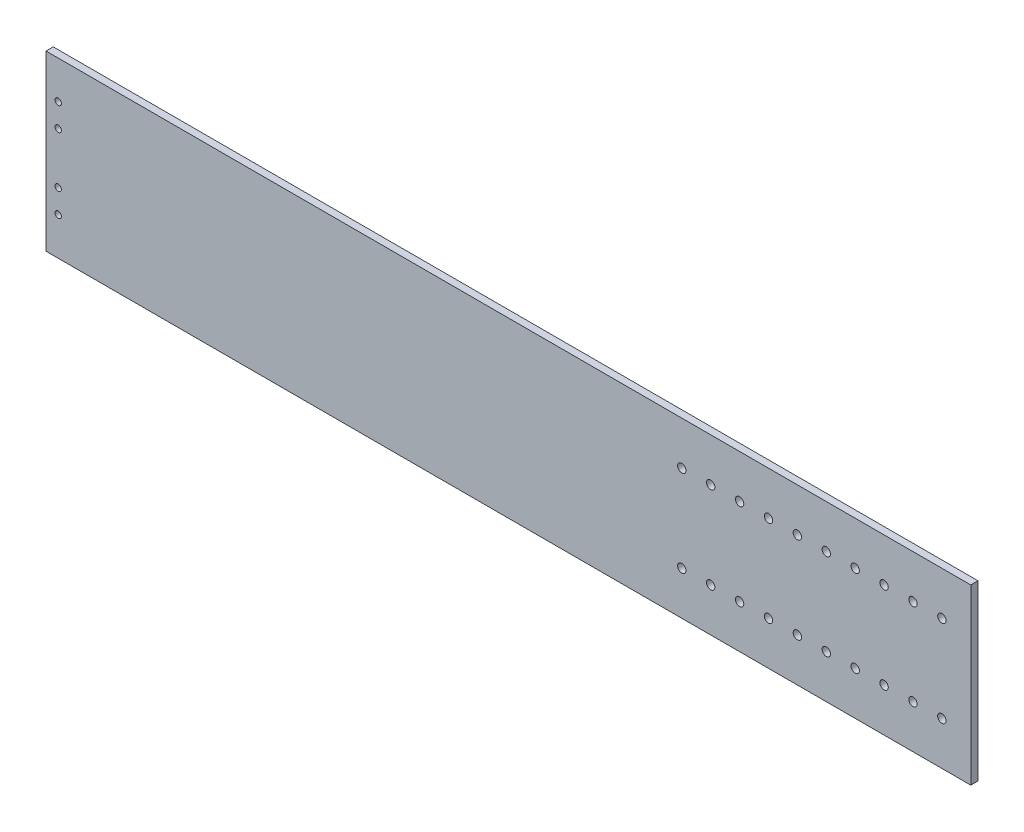
ISO-10303-21;
HEADER;
FILE_DESCRIPTION(('STEP AP214'),'2;1');
FILE_NAME('part.step','',(''),(''),'','','');
FILE_SCHEMA(('AUTOMOTIVE_DESIGN { 1 0 10303 214 1 1 1 1 }'));
ENDSEC;
DATA;
#1=APPLICATION_CONTEXT('core data for automotive mechanical design processes');
#2=APPLICATION_PROTOCOL_DEFINITION('international standard','automotive_design',2000,#1);
#3=PRODUCT_CONTEXT('',#1,'mechanical');
#4=PRODUCT('Part','Part','',(#3));
#5=PRODUCT_RELATED_PRODUCT_CATEGORY('part','',(#4));
#6=PRODUCT_DEFINITION_FORMATION('','',#4);
#7=PRODUCT_DEFINITION_CONTEXT('part definition',#1,'design');
#8=PRODUCT_DEFINITION('design','',#6,#7);
#9=PRODUCT_DEFINITION_SHAPE('','',#8);
#10=(LENGTH_UNIT() NAMED_UNIT(*) SI_UNIT(.MILLI.,.METRE.));
#11=(NAMED_UNIT(*) PLANE_ANGLE_UNIT() SI_UNIT($,.RADIAN.));
#12=(NAMED_UNIT(*) SI_UNIT($,.STERADIAN.) SOLID_ANGLE_UNIT());
#13=UNCERTAINTY_MEASURE_WITH_UNIT(LENGTH_MEASURE(1.E-05),#10,'distance_accuracy_value','');
#14=(GEOMETRIC_REPRESENTATION_CONTEXT(3) GLOBAL_UNCERTAINTY_ASSIGNED_CONTEXT((#13)) GLOBAL_UNIT_ASSIGNED_CONTEXT((#10,
#11,#12)) REPRESENTATION_CONTEXT('',''));
#15=CARTESIAN_POINT('',(0.,0.,0.));
#16=DIRECTION('',(0.,0.,1.));
#17=DIRECTION('',(1.,0.,0.));
#18=AXIS2_PLACEMENT_3D('',#15,#16,#17);
#19=CARTESIAN_POINT('',(0.,0.,3.175));
#20=DIRECTION('',(1.,0.,0.));
#21=DIRECTION('',(0.,0.,-1.));
#22=AXIS2_PLACEMENT_3D('',#19,#20,#21);
#23=PLANE('',#22);
#24=DIRECTION('',(0.,-1.,0.));
#25=VECTOR('',#24,1.);
#26=CARTESIAN_POINT('',(0.,0.,0.));
#27=LINE('',#26,#25);
#28=CARTESIAN_POINT('',(0.,76.2,0.));
#29=VERTEX_POINT('',#28);
#30=CARTESIAN_POINT('',(0.,0.,0.));
#31=VERTEX_POINT('',#30);
#32=EDGE_CURVE('E96',#29,#31,#27,.T.);
#33=ORIENTED_EDGE('',*,*,#32,.T.);
#34=DIRECTION('',(0.,0.,-1.));
#35=VECTOR('',#34,1.);
#36=CARTESIAN_POINT('',(0.,0.,3.175));
#37=LINE('',#36,#35);
#38=CARTESIAN_POINT('',(0.,0.,3.175));
#39=VERTEX_POINT('',#38);
#40=EDGE_CURVE('E11',#39,#31,#37,.T.);
#41=ORIENTED_EDGE('',*,*,#40,.F.);
#42=DIRECTION('',(0.,-1.,0.));
#43=VECTOR('',#42,1.);
#44=CARTESIAN_POINT('',(0.,0.,3.175));
#45=LINE('',#44,#43);
#46=CARTESIAN_POINT('',(0.,76.2,3.175));
#47=VERTEX_POINT('',#46);
#48=EDGE_CURVE('E84',#47,#39,#45,.T.);
#49=ORIENTED_EDGE('',*,*,#48,.F.);
#50=DIRECTION('',(0.,0.,-1.));
#51=VECTOR('',#50,1.);
#52=CARTESIAN_POINT('',(0.,76.2,3.175));
#53=LINE('',#52,#51);
#54=EDGE_CURVE('E92',#47,#29,#53,.T.);
#55=ORIENTED_EDGE('',*,*,#54,.T.);
#56=EDGE_LOOP('',(#33,#41,#49,#55));
#57=FACE_BOUND('',#56,.T.);
#58=ADVANCED_FACE('F33',(#57),#23,.F.);
#59=CARTESIAN_POINT('',(0.,0.,3.175));
#60=DIRECTION('',(0.,1.,0.));
#61=DIRECTION('',(0.,0.,1.));
#62=AXIS2_PLACEMENT_3D('',#59,#60,#61);
#63=PLANE('',#62);
#64=DIRECTION('',(1.,0.,0.));
#65=VECTOR('',#64,1.);
#66=CARTESIAN_POINT('',(0.,0.,0.));
#67=LINE('',#66,#65);
#68=CARTESIAN_POINT('',(406.4,0.,0.));
#69=VERTEX_POINT('',#68);
#70=EDGE_CURVE('E88',#31,#69,#67,.T.);
#71=ORIENTED_EDGE('',*,*,#70,.T.);
#72=DIRECTION('',(0.,0.,-1.));
#73=VECTOR('',#72,1.);
#74=CARTESIAN_POINT('',(406.4,0.,3.175));
#75=LINE('',#74,#73);
#76=CARTESIAN_POINT('',(406.4,0.,3.175));
#77=VERTEX_POINT('',#76);
#78=EDGE_CURVE('E41',#77,#69,#75,.T.);
#79=ORIENTED_EDGE('',*,*,#78,.F.);
#80=DIRECTION('',(1.,0.,0.));
#81=VECTOR('',#80,1.);
#82=CARTESIAN_POINT('',(0.,0.,3.175));
#83=LINE('',#82,#81);
#84=EDGE_CURVE('E79',#39,#77,#83,.T.);
#85=ORIENTED_EDGE('',*,*,#84,.F.);
#86=ORIENTED_EDGE('',*,*,#40,.T.);
#87=EDGE_LOOP('',(#71,#79,#85,#86));
#88=FACE_BOUND('',#87,.T.);
#89=ADVANCED_FACE('F87',(#88),#63,.F.);
#90=CARTESIAN_POINT('',(406.4,0.,3.175));
#91=DIRECTION('',(-1.,0.,0.));
#92=DIRECTION('',(0.,0.,1.));
#93=AXIS2_PLACEMENT_3D('',#90,#91,#92);
#94=PLANE('',#93);
#95=DIRECTION('',(0.,1.,0.));
#96=VECTOR('',#95,1.);
#97=CARTESIAN_POINT('',(406.4,0.,0.));
#98=LINE('',#97,#96);
#99=CARTESIAN_POINT('',(406.4,76.2,0.));
#100=VERTEX_POINT('',#99);
#101=EDGE_CURVE('E66',#69,#100,#98,.T.);
#102=ORIENTED_EDGE('',*,*,#101,.T.);
#103=DIRECTION('',(0.,0.,-1.));
#104=VECTOR('',#103,1.);
#105=CARTESIAN_POINT('',(406.4,76.2,3.175));
#106=LINE('',#105,#104);
#107=CARTESIAN_POINT('',(406.4,76.2,3.175));
#108=VERTEX_POINT('',#107);
#109=EDGE_CURVE('E89',#108,#100,#106,.T.);
#110=ORIENTED_EDGE('',*,*,#109,.F.);
#111=DIRECTION('',(0.,1.,0.));
#112=VECTOR('',#111,1.);
#113=CARTESIAN_POINT('',(406.4,0.,3.175));
#114=LINE('',#113,#112);
#115=EDGE_CURVE('E82',#77,#108,#114,.T.);
#116=ORIENTED_EDGE('',*,*,#115,.F.);
#117=ORIENTED_EDGE('',*,*,#78,.T.);
#118=EDGE_LOOP('',(#102,#110,#116,#117));
#119=FACE_BOUND('',#118,.T.);
#120=ADVANCED_FACE('F90',(#119),#94,.F.);
#121=CARTESIAN_POINT('',(0.,76.2,3.175));
#122=DIRECTION('',(0.,-1.,0.));
#123=DIRECTION('',(0.,0.,-1.));
#124=AXIS2_PLACEMENT_3D('',#121,#122,#123);
#125=PLANE('',#124);
#126=DIRECTION('',(-1.,0.,0.));
#127=VECTOR('',#126,1.);
#128=CARTESIAN_POINT('',(0.,76.2,0.));
#129=LINE('',#128,#127);
#130=EDGE_CURVE('E72',#100,#29,#129,.T.);
#131=ORIENTED_EDGE('',*,*,#130,.T.);
#132=ORIENTED_EDGE('',*,*,#54,.F.);
#133=DIRECTION('',(-1.,0.,0.));
#134=VECTOR('',#133,1.);
#135=CARTESIAN_POINT('',(0.,76.2,3.175));
#136=LINE('',#135,#134);
#137=EDGE_CURVE('E49',#108,#47,#136,.T.);
#138=ORIENTED_EDGE('',*,*,#137,.F.);
#139=ORIENTED_EDGE('',*,*,#109,.T.);
#140=EDGE_LOOP('',(#131,#132,#138,#139));
#141=FACE_BOUND('',#140,.T.);
#142=ADVANCED_FACE('F104',(#141),#125,.F.);
#143=CARTESIAN_POINT('',(0.,76.2,3.175));
#144=DIRECTION('',(0.,0.,-1.));
#145=DIRECTION('',(-1.,0.,0.));
#146=AXIS2_PLACEMENT_3D('',#143,#144,#145);
#147=PLANE('',#146);
#148=CARTESIAN_POINT('',(279.4,19.05,3.175));
#149=DIRECTION('',(0.,0.,1.));
#150=DIRECTION('',(-1.,0.,0.));
#151=AXIS2_PLACEMENT_3D('',#148,#149,#150);
#152=CIRCLE('',#151,1.84150000000001);
#153=CARTESIAN_POINT('',(277.5585,19.05,3.175));
#154=VERTEX_POINT('',#153);
#155=EDGE_CURVE('E248',#154,#154,#152,.T.);
#156=ORIENTED_EDGE('',*,*,#155,.F.);
#157=EDGE_LOOP('',(#156));
#158=FACE_BOUND('',#157,.T.);
#159=CARTESIAN_POINT('',(292.1,19.05,3.175));
#160=DIRECTION('',(0.,0.,1.));
#161=DIRECTION('',(-1.,0.,0.));
#162=AXIS2_PLACEMENT_3D('',#159,#160,#161);
#163=CIRCLE('',#162,1.84150000000001);
#164=CARTESIAN_POINT('',(290.2585,19.05,3.175));
#165=VERTEX_POINT('',#164);
#166=EDGE_CURVE('E242',#165,#165,#163,.T.);
#167=ORIENTED_EDGE('',*,*,#166,.F.);
#168=EDGE_LOOP('',(#167));
#169=FACE_BOUND('',#168,.T.);
#170=CARTESIAN_POINT('',(304.8,19.05,3.175));
#171=DIRECTION('',(0.,0.,1.));
#172=DIRECTION('',(-1.,0.,0.));
#173=AXIS2_PLACEMENT_3D('',#170,#171,#172);
#174=CIRCLE('',#173,1.84150000000001);
#175=CARTESIAN_POINT('',(302.9585,19.05,3.175));
#176=VERTEX_POINT('',#175);
#177=EDGE_CURVE('E236',#176,#176,#174,.T.);
#178=ORIENTED_EDGE('',*,*,#177,.F.);
#179=EDGE_LOOP('',(#178));
#180=FACE_BOUND('',#179,.T.);
#181=CARTESIAN_POINT('',(317.5,19.05,3.175));
#182=DIRECTION('',(0.,0.,1.));
#183=DIRECTION('',(-1.,0.,0.));
#184=AXIS2_PLACEMENT_3D('',#181,#182,#183);
#185=CIRCLE('',#184,1.84149999999996);
#186=CARTESIAN_POINT('',(315.6585,19.05,3.175));
#187=VERTEX_POINT('',#186);
#188=EDGE_CURVE('E230',#187,#187,#185,.T.);
#189=ORIENTED_EDGE('',*,*,#188,.F.);
#190=EDGE_LOOP('',(#189));
#191=FACE_BOUND('',#190,.T.);
#192=CARTESIAN_POINT('',(330.2,19.05,3.175));
#193=DIRECTION('',(0.,0.,1.));
#194=DIRECTION('',(-1.,0.,0.));
#195=AXIS2_PLACEMENT_3D('',#192,#193,#194);
#196=CIRCLE('',#195,1.84150000000001);
#197=CARTESIAN_POINT('',(328.3585,19.05,3.175));
#198=VERTEX_POINT('',#197);
#199=EDGE_CURVE('E224',#198,#198,#196,.T.);
#200=ORIENTED_EDGE('',*,*,#199,.F.);
#201=EDGE_LOOP('',(#200));
#202=FACE_BOUND('',#201,.T.);
#203=CARTESIAN_POINT('',(342.9,19.05,3.175));
#204=DIRECTION('',(0.,0.,1.));
#205=DIRECTION('',(-1.,0.,0.));
#206=AXIS2_PLACEMENT_3D('',#203,#204,#205);
#207=CIRCLE('',#206,1.84150000000001);
#208=CARTESIAN_POINT('',(341.0585,19.05,3.175));
#209=VERTEX_POINT('',#208);
#210=EDGE_CURVE('E218',#209,#209,#207,.T.);
#211=ORIENTED_EDGE('',*,*,#210,.F.);
#212=EDGE_LOOP('',(#211));
#213=FACE_BOUND('',#212,.T.);
#214=CARTESIAN_POINT('',(355.6,19.05,3.175));
#215=DIRECTION('',(0.,0.,1.));
#216=DIRECTION('',(-1.,0.,0.));
#217=AXIS2_PLACEMENT_3D('',#214,#215,#216);
#218=CIRCLE('',#217,1.84150000000001);
#219=CARTESIAN_POINT('',(353.7585,19.05,3.175));
#220=VERTEX_POINT('',#219);
#221=EDGE_CURVE('E212',#220,#220,#218,.T.);
#222=ORIENTED_EDGE('',*,*,#221,.F.);
#223=EDGE_LOOP('',(#222));
#224=FACE_BOUND('',#223,.T.);
#225=CARTESIAN_POINT('',(368.3,19.05,3.175));
#226=DIRECTION('',(0.,0.,1.));
#227=DIRECTION('',(-1.,0.,0.));
#228=AXIS2_PLACEMENT_3D('',#225,#226,#227);
#229=CIRCLE('',#228,1.84150000000001);
#230=CARTESIAN_POINT('',(366.4585,19.05,3.175));
#231=VERTEX_POINT('',#230);
#232=EDGE_CURVE('E206',#231,#231,#229,.T.);
#233=ORIENTED_EDGE('',*,*,#232,.F.);
#234=EDGE_LOOP('',(#233));
#235=FACE_BOUND('',#234,.T.);
#236=CARTESIAN_POINT('',(381.,19.05,3.175));
#237=DIRECTION('',(0.,0.,1.));
#238=DIRECTION('',(-1.,0.,0.));
#239=AXIS2_PLACEMENT_3D('',#236,#237,#238);
#240=CIRCLE('',#239,1.84149999999996);
#241=CARTESIAN_POINT('',(379.1585,19.05,3.175));
#242=VERTEX_POINT('',#241);
#243=EDGE_CURVE('E200',#242,#242,#240,.T.);
#244=ORIENTED_EDGE('',*,*,#243,.F.);
#245=EDGE_LOOP('',(#244));
#246=FACE_BOUND('',#245,.T.);
#247=CARTESIAN_POINT('',(393.7,19.05,3.175));
#248=DIRECTION('',(0.,0.,1.));
#249=DIRECTION('',(-1.,0.,0.));
#250=AXIS2_PLACEMENT_3D('',#247,#248,#249);
#251=CIRCLE('',#250,1.84150000000001);
#252=CARTESIAN_POINT('',(391.8585,19.05,3.175));
#253=VERTEX_POINT('',#252);
#254=EDGE_CURVE('E194',#253,#253,#251,.T.);
#255=ORIENTED_EDGE('',*,*,#254,.F.);
#256=EDGE_LOOP('',(#255));
#257=FACE_BOUND('',#256,.T.);
#258=CARTESIAN_POINT('',(393.7,57.15,3.175));
#259=DIRECTION('',(0.,0.,1.));
#260=DIRECTION('',(1.,0.,0.));
#261=AXIS2_PLACEMENT_3D('',#258,#259,#260);
#262=CIRCLE('',#261,1.84150000000001);
#263=CARTESIAN_POINT('',(395.5415,57.15,3.175));
#264=VERTEX_POINT('',#263);
#265=EDGE_CURVE('E188',#264,#264,#262,.T.);
#266=ORIENTED_EDGE('',*,*,#265,.F.);
#267=EDGE_LOOP('',(#266));
#268=FACE_BOUND('',#267,.T.);
#269=CARTESIAN_POINT('',(381.,57.15,3.175));
#270=DIRECTION('',(0.,0.,1.));
#271=DIRECTION('',(1.,0.,0.));
#272=AXIS2_PLACEMENT_3D('',#269,#270,#271);
#273=CIRCLE('',#272,1.84149999999996);
#274=CARTESIAN_POINT('',(382.8415,57.15,3.175));
#275=VERTEX_POINT('',#274);
#276=EDGE_CURVE('E182',#275,#275,#273,.T.);
#277=ORIENTED_EDGE('',*,*,#276,.F.);
#278=EDGE_LOOP('',(#277));
#279=FACE_BOUND('',#278,.T.);
#280=CARTESIAN_POINT('',(368.3,57.15,3.175));
#281=DIRECTION('',(0.,0.,1.));
#282=DIRECTION('',(1.,0.,0.));
#283=AXIS2_PLACEMENT_3D('',#280,#281,#282);
#284=CIRCLE('',#283,1.84150000000001);
#285=CARTESIAN_POINT('',(370.1415,57.15,3.175));
#286=VERTEX_POINT('',#285);
#287=EDGE_CURVE('E176',#286,#286,#284,.T.);
#288=ORIENTED_EDGE('',*,*,#287,.F.);
#289=EDGE_LOOP('',(#288));
#290=FACE_BOUND('',#289,.T.);
#291=CARTESIAN_POINT('',(355.6,57.15,3.175));
#292=DIRECTION('',(0.,0.,1.));
#293=DIRECTION('',(1.,0.,0.));
#294=AXIS2_PLACEMENT_3D('',#291,#292,#293);
#295=CIRCLE('',#294,1.84150000000001);
#296=CARTESIAN_POINT('',(357.4415,57.15,3.175));
#297=VERTEX_POINT('',#296);
#298=EDGE_CURVE('E170',#297,#297,#295,.T.);
#299=ORIENTED_EDGE('',*,*,#298,.F.);
#300=EDGE_LOOP('',(#299));
#301=FACE_BOUND('',#300,.T.);
#302=CARTESIAN_POINT('',(342.9,57.15,3.175));
#303=DIRECTION('',(0.,0.,1.));
#304=DIRECTION('',(1.,0.,0.));
#305=AXIS2_PLACEMENT_3D('',#302,#303,#304);
#306=CIRCLE('',#305,1.84150000000001);
#307=CARTESIAN_POINT('',(344.7415,57.15,3.175));
#308=VERTEX_POINT('',#307);
#309=EDGE_CURVE('E164',#308,#308,#306,.T.);
#310=ORIENTED_EDGE('',*,*,#309,.F.);
#311=EDGE_LOOP('',(#310));
#312=FACE_BOUND('',#311,.T.);
#313=CARTESIAN_POINT('',(330.2,57.15,3.175));
#314=DIRECTION('',(0.,0.,1.));
#315=DIRECTION('',(1.,0.,0.));
#316=AXIS2_PLACEMENT_3D('',#313,#314,#315);
#317=CIRCLE('',#316,1.84150000000001);
#318=CARTESIAN_POINT('',(332.0415,57.15,3.175));
#319=VERTEX_POINT('',#318);
#320=EDGE_CURVE('E158',#319,#319,#317,.T.);
#321=ORIENTED_EDGE('',*,*,#320,.F.);
#322=EDGE_LOOP('',(#321));
#323=FACE_BOUND('',#322,.T.);
#324=CARTESIAN_POINT('',(317.5,57.15,3.175));
#325=DIRECTION('',(0.,0.,1.));
#326=DIRECTION('',(1.,0.,0.));
#327=AXIS2_PLACEMENT_3D('',#324,#325,#326);
#328=CIRCLE('',#327,1.84149999999996);
#329=CARTESIAN_POINT('',(319.3415,57.15,3.175));
#330=VERTEX_POINT('',#329);
#331=EDGE_CURVE('E152',#330,#330,#328,.T.);
#332=ORIENTED_EDGE('',*,*,#331,.F.);
#333=EDGE_LOOP('',(#332));
#334=FACE_BOUND('',#333,.T.);
#335=CARTESIAN_POINT('',(304.8,57.15,3.175));
#336=DIRECTION('',(0.,0.,1.));
#337=DIRECTION('',(1.,0.,0.));
#338=AXIS2_PLACEMENT_3D('',#335,#336,#337);
#339=CIRCLE('',#338,1.84150000000001);
#340=CARTESIAN_POINT('',(306.6415,57.15,3.175));
#341=VERTEX_POINT('',#340);
#342=EDGE_CURVE('E146',#341,#341,#339,.T.);
#343=ORIENTED_EDGE('',*,*,#342,.F.);
#344=EDGE_LOOP('',(#343));
#345=FACE_BOUND('',#344,.T.);
#346=CARTESIAN_POINT('',(292.1,57.15,3.175));
#347=DIRECTION('',(0.,0.,1.));
#348=DIRECTION('',(1.,0.,0.));
#349=AXIS2_PLACEMENT_3D('',#346,#347,#348);
#350=CIRCLE('',#349,1.84150000000001);
#351=CARTESIAN_POINT('',(293.9415,57.15,3.175));
#352=VERTEX_POINT('',#351);
#353=EDGE_CURVE('E140',#352,#352,#350,.T.);
#354=ORIENTED_EDGE('',*,*,#353,.F.);
#355=EDGE_LOOP('',(#354));
#356=FACE_BOUND('',#355,.T.);
#357=CARTESIAN_POINT('',(279.4,57.15,3.175));
#358=DIRECTION('',(0.,0.,1.));
#359=DIRECTION('',(1.,0.,0.));
#360=AXIS2_PLACEMENT_3D('',#357,#358,#359);
#361=CIRCLE('',#360,1.84150000000001);
#362=CARTESIAN_POINT('',(281.2415,57.15,3.175));
#363=VERTEX_POINT('',#362);
#364=EDGE_CURVE('E134',#363,#363,#361,.T.);
#365=ORIENTED_EDGE('',*,*,#364,.F.);
#366=EDGE_LOOP('',(#365));
#367=FACE_BOUND('',#366,.T.);
#368=CARTESIAN_POINT('',(5.35940000000002,26.8986,3.175));
#369=DIRECTION('',(0.,0.,1.));
#370=DIRECTION('',(-1.,0.,0.));
#371=AXIS2_PLACEMENT_3D('',#368,#369,#370);
#372=CIRCLE('',#371,1.397);
#373=CARTESIAN_POINT('',(3.96240000000002,26.8986,3.175));
#374=VERTEX_POINT('',#373);
#375=EDGE_CURVE('E128',#374,#374,#372,.T.);
#376=ORIENTED_EDGE('',*,*,#375,.F.);
#377=EDGE_LOOP('',(#376));
#378=FACE_BOUND('',#377,.T.);
#379=CARTESIAN_POINT('',(5.35940000000002,49.3014,3.175));
#380=DIRECTION('',(0.,0.,1.));
#381=DIRECTION('',(1.,0.,0.));
#382=AXIS2_PLACEMENT_3D('',#379,#380,#381);
#383=CIRCLE('',#382,1.397);
#384=CARTESIAN_POINT('',(6.75640000000002,49.3014,3.175));
#385=VERTEX_POINT('',#384);
#386=EDGE_CURVE('E122',#385,#385,#383,.T.);
#387=ORIENTED_EDGE('',*,*,#386,.F.);
#388=EDGE_LOOP('',(#387));
#389=FACE_BOUND('',#388,.T.);
#390=CARTESIAN_POINT('',(5.35940000000001,16.6116,3.175));
#391=DIRECTION('',(0.,0.,1.));
#392=DIRECTION('',(-1.,0.,0.));
#393=AXIS2_PLACEMENT_3D('',#390,#391,#392);
#394=CIRCLE('',#393,1.397);
#395=CARTESIAN_POINT('',(3.96240000000001,16.6116,3.175));
#396=VERTEX_POINT('',#395);
#397=EDGE_CURVE('E116',#396,#396,#394,.T.);
#398=ORIENTED_EDGE('',*,*,#397,.F.);
#399=EDGE_LOOP('',(#398));
#400=FACE_BOUND('',#399,.T.);
#401=CARTESIAN_POINT('',(5.35940000000001,59.5884,3.175));
#402=DIRECTION('',(0.,0.,1.));
#403=DIRECTION('',(1.,0.,0.));
#404=AXIS2_PLACEMENT_3D('',#401,#402,#403);
#405=CIRCLE('',#404,1.397);
#406=CARTESIAN_POINT('',(6.75640000000001,59.5884,3.175));
#407=VERTEX_POINT('',#406);
#408=EDGE_CURVE('E110',#407,#407,#405,.T.);
#409=ORIENTED_EDGE('',*,*,#408,.F.);
#410=EDGE_LOOP('',(#409));
#411=FACE_BOUND('',#410,.T.);
#412=ORIENTED_EDGE('',*,*,#48,.T.);
#413=ORIENTED_EDGE('',*,*,#84,.T.);
#414=ORIENTED_EDGE('',*,*,#115,.T.);
#415=ORIENTED_EDGE('',*,*,#137,.T.);
#416=EDGE_LOOP('',(#412,#413,#414,#415));
#417=FACE_BOUND('',#416,.T.);
#418=ADVANCED_FACE('F80',(#158,#169,#180,#191,#202,#213,#224,#235,#246,#257,#268,#279,#290,#301,
#312,#323,#334,#345,#356,#367,#378,#389,#400,#411,#417),#147,.F.);
#419=CARTESIAN_POINT('',(0.,76.2,0.));
#420=DIRECTION('',(0.,0.,-1.));
#421=DIRECTION('',(-1.,0.,0.));
#422=AXIS2_PLACEMENT_3D('',#419,#420,#421);
#423=PLANE('',#422);
#424=CARTESIAN_POINT('',(279.4,19.05,0.));
#425=DIRECTION('',(0.,0.,1.));
#426=DIRECTION('',(-1.,0.,0.));
#427=AXIS2_PLACEMENT_3D('',#424,#425,#426);
#428=CIRCLE('',#427,1.84150000000001);
#429=CARTESIAN_POINT('',(277.5585,19.05,0.));
#430=VERTEX_POINT('',#429);
#431=EDGE_CURVE('E245',#430,#430,#428,.T.);
#432=ORIENTED_EDGE('',*,*,#431,.T.);
#433=EDGE_LOOP('',(#432));
#434=FACE_BOUND('',#433,.T.);
#435=CARTESIAN_POINT('',(292.1,19.05,0.));
#436=DIRECTION('',(0.,0.,1.));
#437=DIRECTION('',(-1.,0.,0.));
#438=AXIS2_PLACEMENT_3D('',#435,#436,#437);
#439=CIRCLE('',#438,1.84150000000001);
#440=CARTESIAN_POINT('',(290.2585,19.05,0.));
#441=VERTEX_POINT('',#440);
#442=EDGE_CURVE('E239',#441,#441,#439,.T.);
#443=ORIENTED_EDGE('',*,*,#442,.T.);
#444=EDGE_LOOP('',(#443));
#445=FACE_BOUND('',#444,.T.);
#446=CARTESIAN_POINT('',(304.8,19.05,0.));
#447=DIRECTION('',(0.,0.,1.));
#448=DIRECTION('',(-1.,0.,0.));
#449=AXIS2_PLACEMENT_3D('',#446,#447,#448);
#450=CIRCLE('',#449,1.84150000000001);
#451=CARTESIAN_POINT('',(302.9585,19.05,0.));
#452=VERTEX_POINT('',#451);
#453=EDGE_CURVE('E233',#452,#452,#450,.T.);
#454=ORIENTED_EDGE('',*,*,#453,.T.);
#455=EDGE_LOOP('',(#454));
#456=FACE_BOUND('',#455,.T.);
#457=CARTESIAN_POINT('',(317.5,19.05,0.));
#458=DIRECTION('',(0.,0.,1.));
#459=DIRECTION('',(-1.,0.,0.));
#460=AXIS2_PLACEMENT_3D('',#457,#458,#459);
#461=CIRCLE('',#460,1.84149999999996);
#462=CARTESIAN_POINT('',(315.6585,19.05,0.));
#463=VERTEX_POINT('',#462);
#464=EDGE_CURVE('E227',#463,#463,#461,.T.);
#465=ORIENTED_EDGE('',*,*,#464,.T.);
#466=EDGE_LOOP('',(#465));
#467=FACE_BOUND('',#466,.T.);
#468=CARTESIAN_POINT('',(330.2,19.05,0.));
#469=DIRECTION('',(0.,0.,1.));
#470=DIRECTION('',(-1.,0.,0.));
#471=AXIS2_PLACEMENT_3D('',#468,#469,#470);
#472=CIRCLE('',#471,1.84150000000001);
#473=CARTESIAN_POINT('',(328.3585,19.05,0.));
#474=VERTEX_POINT('',#473);
#475=EDGE_CURVE('E221',#474,#474,#472,.T.);
#476=ORIENTED_EDGE('',*,*,#475,.T.);
#477=EDGE_LOOP('',(#476));
#478=FACE_BOUND('',#477,.T.);
#479=CARTESIAN_POINT('',(342.9,19.05,0.));
#480=DIRECTION('',(0.,0.,1.));
#481=DIRECTION('',(-1.,0.,0.));
#482=AXIS2_PLACEMENT_3D('',#479,#480,#481);
#483=CIRCLE('',#482,1.84150000000001);
#484=CARTESIAN_POINT('',(341.0585,19.05,0.));
#485=VERTEX_POINT('',#484);
#486=EDGE_CURVE('E215',#485,#485,#483,.T.);
#487=ORIENTED_EDGE('',*,*,#486,.T.);
#488=EDGE_LOOP('',(#487));
#489=FACE_BOUND('',#488,.T.);
#490=CARTESIAN_POINT('',(355.6,19.05,0.));
#491=DIRECTION('',(0.,0.,1.));
#492=DIRECTION('',(-1.,0.,0.));
#493=AXIS2_PLACEMENT_3D('',#490,#491,#492);
#494=CIRCLE('',#493,1.84150000000001);
#495=CARTESIAN_POINT('',(353.7585,19.05,0.));
#496=VERTEX_POINT('',#495);
#497=EDGE_CURVE('E209',#496,#496,#494,.T.);
#498=ORIENTED_EDGE('',*,*,#497,.T.);
#499=EDGE_LOOP('',(#498));
#500=FACE_BOUND('',#499,.T.);
#501=CARTESIAN_POINT('',(368.3,19.05,0.));
#502=DIRECTION('',(0.,0.,1.));
#503=DIRECTION('',(-1.,0.,0.));
#504=AXIS2_PLACEMENT_3D('',#501,#502,#503);
#505=CIRCLE('',#504,1.84150000000001);
#506=CARTESIAN_POINT('',(366.4585,19.05,0.));
#507=VERTEX_POINT('',#506);
#508=EDGE_CURVE('E203',#507,#507,#505,.T.);
#509=ORIENTED_EDGE('',*,*,#508,.T.);
#510=EDGE_LOOP('',(#509));
#511=FACE_BOUND('',#510,.T.);
#512=CARTESIAN_POINT('',(381.,19.05,0.));
#513=DIRECTION('',(0.,0.,1.));
#514=DIRECTION('',(-1.,0.,0.));
#515=AXIS2_PLACEMENT_3D('',#512,#513,#514);
#516=CIRCLE('',#515,1.84149999999996);
#517=CARTESIAN_POINT('',(379.1585,19.05,0.));
#518=VERTEX_POINT('',#517);
#519=EDGE_CURVE('E197',#518,#518,#516,.T.);
#520=ORIENTED_EDGE('',*,*,#519,.T.);
#521=EDGE_LOOP('',(#520));
#522=FACE_BOUND('',#521,.T.);
#523=CARTESIAN_POINT('',(393.7,19.05,0.));
#524=DIRECTION('',(0.,0.,1.));
#525=DIRECTION('',(-1.,0.,0.));
#526=AXIS2_PLACEMENT_3D('',#523,#524,#525);
#527=CIRCLE('',#526,1.84150000000001);
#528=CARTESIAN_POINT('',(391.8585,19.05,0.));
#529=VERTEX_POINT('',#528);
#530=EDGE_CURVE('E191',#529,#529,#527,.T.);
#531=ORIENTED_EDGE('',*,*,#530,.T.);
#532=EDGE_LOOP('',(#531));
#533=FACE_BOUND('',#532,.T.);
#534=CARTESIAN_POINT('',(393.7,57.15,0.));
#535=DIRECTION('',(0.,0.,1.));
#536=DIRECTION('',(1.,0.,0.));
#537=AXIS2_PLACEMENT_3D('',#534,#535,#536);
#538=CIRCLE('',#537,1.84150000000001);
#539=CARTESIAN_POINT('',(395.5415,57.15,0.));
#540=VERTEX_POINT('',#539);
#541=EDGE_CURVE('E185',#540,#540,#538,.T.);
#542=ORIENTED_EDGE('',*,*,#541,.T.);
#543=EDGE_LOOP('',(#542));
#544=FACE_BOUND('',#543,.T.);
#545=CARTESIAN_POINT('',(381.,57.15,0.));
#546=DIRECTION('',(0.,0.,1.));
#547=DIRECTION('',(1.,0.,0.));
#548=AXIS2_PLACEMENT_3D('',#545,#546,#547);
#549=CIRCLE('',#548,1.84149999999996);
#550=CARTESIAN_POINT('',(382.8415,57.15,0.));
#551=VERTEX_POINT('',#550);
#552=EDGE_CURVE('E179',#551,#551,#549,.T.);
#553=ORIENTED_EDGE('',*,*,#552,.T.);
#554=EDGE_LOOP('',(#553));
#555=FACE_BOUND('',#554,.T.);
#556=CARTESIAN_POINT('',(368.3,57.15,0.));
#557=DIRECTION('',(0.,0.,1.));
#558=DIRECTION('',(1.,0.,0.));
#559=AXIS2_PLACEMENT_3D('',#556,#557,#558);
#560=CIRCLE('',#559,1.84150000000001);
#561=CARTESIAN_POINT('',(370.1415,57.15,0.));
#562=VERTEX_POINT('',#561);
#563=EDGE_CURVE('E173',#562,#562,#560,.T.);
#564=ORIENTED_EDGE('',*,*,#563,.T.);
#565=EDGE_LOOP('',(#564));
#566=FACE_BOUND('',#565,.T.);
#567=CARTESIAN_POINT('',(355.6,57.15,0.));
#568=DIRECTION('',(0.,0.,1.));
#569=DIRECTION('',(1.,0.,0.));
#570=AXIS2_PLACEMENT_3D('',#567,#568,#569);
#571=CIRCLE('',#570,1.84150000000001);
#572=CARTESIAN_POINT('',(357.4415,57.15,0.));
#573=VERTEX_POINT('',#572);
#574=EDGE_CURVE('E167',#573,#573,#571,.T.);
#575=ORIENTED_EDGE('',*,*,#574,.T.);
#576=EDGE_LOOP('',(#575));
#577=FACE_BOUND('',#576,.T.);
#578=CARTESIAN_POINT('',(342.9,57.15,0.));
#579=DIRECTION('',(0.,0.,1.));
#580=DIRECTION('',(1.,0.,0.));
#581=AXIS2_PLACEMENT_3D('',#578,#579,#580);
#582=CIRCLE('',#581,1.84150000000001);
#583=CARTESIAN_POINT('',(344.7415,57.15,0.));
#584=VERTEX_POINT('',#583);
#585=EDGE_CURVE('E161',#584,#584,#582,.T.);
#586=ORIENTED_EDGE('',*,*,#585,.T.);
#587=EDGE_LOOP('',(#586));
#588=FACE_BOUND('',#587,.T.);
#589=CARTESIAN_POINT('',(330.2,57.15,0.));
#590=DIRECTION('',(0.,0.,1.));
#591=DIRECTION('',(1.,0.,0.));
#592=AXIS2_PLACEMENT_3D('',#589,#590,#591);
#593=CIRCLE('',#592,1.84150000000001);
#594=CARTESIAN_POINT('',(332.0415,57.15,0.));
#595=VERTEX_POINT('',#594);
#596=EDGE_CURVE('E155',#595,#595,#593,.T.);
#597=ORIENTED_EDGE('',*,*,#596,.T.);
#598=EDGE_LOOP('',(#597));
#599=FACE_BOUND('',#598,.T.);
#600=CARTESIAN_POINT('',(317.5,57.15,0.));
#601=DIRECTION('',(0.,0.,1.));
#602=DIRECTION('',(1.,0.,0.));
#603=AXIS2_PLACEMENT_3D('',#600,#601,#602);
#604=CIRCLE('',#603,1.84149999999996);
#605=CARTESIAN_POINT('',(319.3415,57.15,0.));
#606=VERTEX_POINT('',#605);
#607=EDGE_CURVE('E149',#606,#606,#604,.T.);
#608=ORIENTED_EDGE('',*,*,#607,.T.);
#609=EDGE_LOOP('',(#608));
#610=FACE_BOUND('',#609,.T.);
#611=CARTESIAN_POINT('',(304.8,57.15,0.));
#612=DIRECTION('',(0.,0.,1.));
#613=DIRECTION('',(1.,0.,0.));
#614=AXIS2_PLACEMENT_3D('',#611,#612,#613);
#615=CIRCLE('',#614,1.84150000000001);
#616=CARTESIAN_POINT('',(306.6415,57.15,0.));
#617=VERTEX_POINT('',#616);
#618=EDGE_CURVE('E143',#617,#617,#615,.T.);
#619=ORIENTED_EDGE('',*,*,#618,.T.);
#620=EDGE_LOOP('',(#619));
#621=FACE_BOUND('',#620,.T.);
#622=CARTESIAN_POINT('',(292.1,57.15,0.));
#623=DIRECTION('',(0.,0.,1.));
#624=DIRECTION('',(1.,0.,0.));
#625=AXIS2_PLACEMENT_3D('',#622,#623,#624);
#626=CIRCLE('',#625,1.84150000000001);
#627=CARTESIAN_POINT('',(293.9415,57.15,0.));
#628=VERTEX_POINT('',#627);
#629=EDGE_CURVE('E137',#628,#628,#626,.T.);
#630=ORIENTED_EDGE('',*,*,#629,.T.);
#631=EDGE_LOOP('',(#630));
#632=FACE_BOUND('',#631,.T.);
#633=CARTESIAN_POINT('',(279.4,57.15,0.));
#634=DIRECTION('',(0.,0.,1.));
#635=DIRECTION('',(1.,0.,0.));
#636=AXIS2_PLACEMENT_3D('',#633,#634,#635);
#637=CIRCLE('',#636,1.84150000000001);
#638=CARTESIAN_POINT('',(281.2415,57.15,0.));
#639=VERTEX_POINT('',#638);
#640=EDGE_CURVE('E131',#639,#639,#637,.T.);
#641=ORIENTED_EDGE('',*,*,#640,.T.);
#642=EDGE_LOOP('',(#641));
#643=FACE_BOUND('',#642,.T.);
#644=CARTESIAN_POINT('',(5.35940000000002,26.8986,0.));
#645=DIRECTION('',(0.,0.,1.));
#646=DIRECTION('',(-1.,0.,0.));
#647=AXIS2_PLACEMENT_3D('',#644,#645,#646);
#648=CIRCLE('',#647,1.397);
#649=CARTESIAN_POINT('',(3.96240000000002,26.8986,0.));
#650=VERTEX_POINT('',#649);
#651=EDGE_CURVE('E125',#650,#650,#648,.T.);
#652=ORIENTED_EDGE('',*,*,#651,.T.);
#653=EDGE_LOOP('',(#652));
#654=FACE_BOUND('',#653,.T.);
#655=CARTESIAN_POINT('',(5.35940000000002,49.3014,0.));
#656=DIRECTION('',(0.,0.,1.));
#657=DIRECTION('',(1.,0.,0.));
#658=AXIS2_PLACEMENT_3D('',#655,#656,#657);
#659=CIRCLE('',#658,1.397);
#660=CARTESIAN_POINT('',(6.75640000000002,49.3014,0.));
#661=VERTEX_POINT('',#660);
#662=EDGE_CURVE('E119',#661,#661,#659,.T.);
#663=ORIENTED_EDGE('',*,*,#662,.T.);
#664=EDGE_LOOP('',(#663));
#665=FACE_BOUND('',#664,.T.);
#666=CARTESIAN_POINT('',(5.35940000000001,16.6116,0.));
#667=DIRECTION('',(0.,0.,1.));
#668=DIRECTION('',(-1.,0.,0.));
#669=AXIS2_PLACEMENT_3D('',#666,#667,#668);
#670=CIRCLE('',#669,1.397);
#671=CARTESIAN_POINT('',(3.96240000000001,16.6116,0.));
#672=VERTEX_POINT('',#671);
#673=EDGE_CURVE('E113',#672,#672,#670,.T.);
#674=ORIENTED_EDGE('',*,*,#673,.T.);
#675=EDGE_LOOP('',(#674));
#676=FACE_BOUND('',#675,.T.);
#677=CARTESIAN_POINT('',(5.35940000000001,59.5884,0.));
#678=DIRECTION('',(0.,0.,1.));
#679=DIRECTION('',(1.,0.,0.));
#680=AXIS2_PLACEMENT_3D('',#677,#678,#679);
#681=CIRCLE('',#680,1.397);
#682=CARTESIAN_POINT('',(6.75640000000001,59.5884,0.));
#683=VERTEX_POINT('',#682);
#684=EDGE_CURVE('E99',#683,#683,#681,.T.);
#685=ORIENTED_EDGE('',*,*,#684,.T.);
#686=EDGE_LOOP('',(#685));
#687=FACE_BOUND('',#686,.T.);
#688=ORIENTED_EDGE('',*,*,#32,.F.);
#689=ORIENTED_EDGE('',*,*,#130,.F.);
#690=ORIENTED_EDGE('',*,*,#101,.F.);
#691=ORIENTED_EDGE('',*,*,#70,.F.);
#692=EDGE_LOOP('',(#688,#689,#690,#691));
#693=FACE_BOUND('',#692,.T.);
#694=ADVANCED_FACE('F107',(#434,#445,#456,#467,#478,#489,#500,#511,#522,#533,#544,#555,#566,
#577,#588,#599,#610,#621,#632,#643,#654,#665,#676,#687,#693),#423,.T.);
#695=CARTESIAN_POINT('',(5.35940000000001,59.5884,0.));
#696=DIRECTION('',(0.,0.,1.));
#697=DIRECTION('',(1.,0.,0.));
#698=AXIS2_PLACEMENT_3D('',#695,#696,#697);
#699=CYLINDRICAL_SURFACE('',#698,1.397);
#700=ORIENTED_EDGE('',*,*,#684,.F.);
#701=EDGE_LOOP('',(#700));
#702=FACE_BOUND('',#701,.T.);
#703=ORIENTED_EDGE('',*,*,#408,.T.);
#704=EDGE_LOOP('',(#703));
#705=FACE_BOUND('',#704,.T.);
#706=ADVANCED_FACE('F312',(#702,#705),#699,.F.);
#707=CARTESIAN_POINT('',(5.35940000000001,16.6116,0.));
#708=DIRECTION('',(0.,0.,1.));
#709=DIRECTION('',(1.,0.,0.));
#710=AXIS2_PLACEMENT_3D('',#707,#708,#709);
#711=CYLINDRICAL_SURFACE('',#710,1.397);
#712=ORIENTED_EDGE('',*,*,#673,.F.);
#713=EDGE_LOOP('',(#712));
#714=FACE_BOUND('',#713,.T.);
#715=ORIENTED_EDGE('',*,*,#397,.T.);
#716=EDGE_LOOP('',(#715));
#717=FACE_BOUND('',#716,.T.);
#718=ADVANCED_FACE('F314',(#714,#717),#711,.F.);
#719=CARTESIAN_POINT('',(5.35940000000002,49.3014,0.));
#720=DIRECTION('',(0.,0.,1.));
#721=DIRECTION('',(1.,0.,0.));
#722=AXIS2_PLACEMENT_3D('',#719,#720,#721);
#723=CYLINDRICAL_SURFACE('',#722,1.397);
#724=ORIENTED_EDGE('',*,*,#662,.F.);
#725=EDGE_LOOP('',(#724));
#726=FACE_BOUND('',#725,.T.);
#727=ORIENTED_EDGE('',*,*,#386,.T.);
#728=EDGE_LOOP('',(#727));
#729=FACE_BOUND('',#728,.T.);
#730=ADVANCED_FACE('F321',(#726,#729),#723,.F.);
#731=CARTESIAN_POINT('',(5.35940000000002,26.8986,0.));
#732=DIRECTION('',(0.,0.,1.));
#733=DIRECTION('',(1.,0.,0.));
#734=AXIS2_PLACEMENT_3D('',#731,#732,#733);
#735=CYLINDRICAL_SURFACE('',#734,1.397);
#736=ORIENTED_EDGE('',*,*,#651,.F.);
#737=EDGE_LOOP('',(#736));
#738=FACE_BOUND('',#737,.T.);
#739=ORIENTED_EDGE('',*,*,#375,.T.);
#740=EDGE_LOOP('',(#739));
#741=FACE_BOUND('',#740,.T.);
#742=ADVANCED_FACE('F361',(#738,#741),#735,.F.);
#743=CARTESIAN_POINT('',(279.4,57.15,0.));
#744=DIRECTION('',(0.,0.,1.));
#745=DIRECTION('',(1.,0.,0.));
#746=AXIS2_PLACEMENT_3D('',#743,#744,#745);
#747=CYLINDRICAL_SURFACE('',#746,1.84150000000001);
#748=ORIENTED_EDGE('',*,*,#640,.F.);
#749=EDGE_LOOP('',(#748));
#750=FACE_BOUND('',#749,.T.);
#751=ORIENTED_EDGE('',*,*,#364,.T.);
#752=EDGE_LOOP('',(#751));
#753=FACE_BOUND('',#752,.T.);
#754=ADVANCED_FACE('F355',(#750,#753),#747,.F.);
#755=CARTESIAN_POINT('',(292.1,57.15,0.));
#756=DIRECTION('',(0.,0.,1.));
#757=DIRECTION('',(1.,0.,0.));
#758=AXIS2_PLACEMENT_3D('',#755,#756,#757);
#759=CYLINDRICAL_SURFACE('',#758,1.84150000000001);
#760=ORIENTED_EDGE('',*,*,#629,.F.);
#761=EDGE_LOOP('',(#760));
#762=FACE_BOUND('',#761,.T.);
#763=ORIENTED_EDGE('',*,*,#353,.T.);
#764=EDGE_LOOP('',(#763));
#765=FACE_BOUND('',#764,.T.);
#766=ADVANCED_FACE('F360',(#762,#765),#759,.F.);
#767=CARTESIAN_POINT('',(304.8,57.15,0.));
#768=DIRECTION('',(0.,0.,1.));
#769=DIRECTION('',(1.,0.,0.));
#770=AXIS2_PLACEMENT_3D('',#767,#768,#769);
#771=CYLINDRICAL_SURFACE('',#770,1.84150000000001);
#772=ORIENTED_EDGE('',*,*,#618,.F.);
#773=EDGE_LOOP('',(#772));
#774=FACE_BOUND('',#773,.T.);
#775=ORIENTED_EDGE('',*,*,#342,.T.);
#776=EDGE_LOOP('',(#775));
#777=FACE_BOUND('',#776,.T.);
#778=ADVANCED_FACE('F373',(#774,#777),#771,.F.);
#779=CARTESIAN_POINT('',(317.5,57.15,0.));
#780=DIRECTION('',(0.,0.,1.));
#781=DIRECTION('',(1.,0.,0.));
#782=AXIS2_PLACEMENT_3D('',#779,#780,#781);
#783=CYLINDRICAL_SURFACE('',#782,1.84149999999996);
#784=ORIENTED_EDGE('',*,*,#607,.F.);
#785=EDGE_LOOP('',(#784));
#786=FACE_BOUND('',#785,.T.);
#787=ORIENTED_EDGE('',*,*,#331,.T.);
#788=EDGE_LOOP('',(#787));
#789=FACE_BOUND('',#788,.T.);
#790=ADVANCED_FACE('F383',(#786,#789),#783,.F.);
#791=CARTESIAN_POINT('',(330.2,57.15,0.));
#792=DIRECTION('',(0.,0.,1.));
#793=DIRECTION('',(1.,0.,0.));
#794=AXIS2_PLACEMENT_3D('',#791,#792,#793);
#795=CYLINDRICAL_SURFACE('',#794,1.84150000000001);
#796=ORIENTED_EDGE('',*,*,#596,.F.);
#797=EDGE_LOOP('',(#796));
#798=FACE_BOUND('',#797,.T.);
#799=ORIENTED_EDGE('',*,*,#320,.T.);
#800=EDGE_LOOP('',(#799));
#801=FACE_BOUND('',#800,.T.);
#802=ADVANCED_FACE('F393',(#798,#801),#795,.F.);
#803=CARTESIAN_POINT('',(342.9,57.15,0.));
#804=DIRECTION('',(0.,0.,1.));
#805=DIRECTION('',(1.,0.,0.));
#806=AXIS2_PLACEMENT_3D('',#803,#804,#805);
#807=CYLINDRICAL_SURFACE('',#806,1.84150000000001);
#808=ORIENTED_EDGE('',*,*,#585,.F.);
#809=EDGE_LOOP('',(#808));
#810=FACE_BOUND('',#809,.T.);
#811=ORIENTED_EDGE('',*,*,#309,.T.);
#812=EDGE_LOOP('',(#811));
#813=FACE_BOUND('',#812,.T.);
#814=ADVANCED_FACE('F403',(#810,#813),#807,.F.);
#815=CARTESIAN_POINT('',(355.6,57.15,0.));
#816=DIRECTION('',(0.,0.,1.));
#817=DIRECTION('',(1.,0.,0.));
#818=AXIS2_PLACEMENT_3D('',#815,#816,#817);
#819=CYLINDRICAL_SURFACE('',#818,1.84150000000001);
#820=ORIENTED_EDGE('',*,*,#574,.F.);
#821=EDGE_LOOP('',(#820));
#822=FACE_BOUND('',#821,.T.);
#823=ORIENTED_EDGE('',*,*,#298,.T.);
#824=EDGE_LOOP('',(#823));
#825=FACE_BOUND('',#824,.T.);
#826=ADVANCED_FACE('F413',(#822,#825),#819,.F.);
#827=CARTESIAN_POINT('',(368.3,57.15,0.));
#828=DIRECTION('',(0.,0.,1.));
#829=DIRECTION('',(1.,0.,0.));
#830=AXIS2_PLACEMENT_3D('',#827,#828,#829);
#831=CYLINDRICAL_SURFACE('',#830,1.84150000000001);
#832=ORIENTED_EDGE('',*,*,#563,.F.);
#833=EDGE_LOOP('',(#832));
#834=FACE_BOUND('',#833,.T.);
#835=ORIENTED_EDGE('',*,*,#287,.T.);
#836=EDGE_LOOP('',(#835));
#837=FACE_BOUND('',#836,.T.);
#838=ADVANCED_FACE('F423',(#834,#837),#831,.F.);
#839=CARTESIAN_POINT('',(381.,57.15,0.));
#840=DIRECTION('',(0.,0.,1.));
#841=DIRECTION('',(1.,0.,0.));
#842=AXIS2_PLACEMENT_3D('',#839,#840,#841);
#843=CYLINDRICAL_SURFACE('',#842,1.84149999999996);
#844=ORIENTED_EDGE('',*,*,#552,.F.);
#845=EDGE_LOOP('',(#844));
#846=FACE_BOUND('',#845,.T.);
#847=ORIENTED_EDGE('',*,*,#276,.T.);
#848=EDGE_LOOP('',(#847));
#849=FACE_BOUND('',#848,.T.);
#850=ADVANCED_FACE('F433',(#846,#849),#843,.F.);
#851=CARTESIAN_POINT('',(393.7,57.15,0.));
#852=DIRECTION('',(0.,0.,1.));
#853=DIRECTION('',(1.,0.,0.));
#854=AXIS2_PLACEMENT_3D('',#851,#852,#853);
#855=CYLINDRICAL_SURFACE('',#854,1.84150000000001);
#856=ORIENTED_EDGE('',*,*,#541,.F.);
#857=EDGE_LOOP('',(#856));
#858=FACE_BOUND('',#857,.T.);
#859=ORIENTED_EDGE('',*,*,#265,.T.);
#860=EDGE_LOOP('',(#859));
#861=FACE_BOUND('',#860,.T.);
#862=ADVANCED_FACE('F443',(#858,#861),#855,.F.);
#863=CARTESIAN_POINT('',(393.7,19.05,0.));
#864=DIRECTION('',(0.,0.,1.));
#865=DIRECTION('',(1.,0.,0.));
#866=AXIS2_PLACEMENT_3D('',#863,#864,#865);
#867=CYLINDRICAL_SURFACE('',#866,1.84150000000001);
#868=ORIENTED_EDGE('',*,*,#530,.F.);
#869=EDGE_LOOP('',(#868));
#870=FACE_BOUND('',#869,.T.);
#871=ORIENTED_EDGE('',*,*,#254,.T.);
#872=EDGE_LOOP('',(#871));
#873=FACE_BOUND('',#872,.T.);
#874=ADVANCED_FACE('F453',(#870,#873),#867,.F.);
#875=CARTESIAN_POINT('',(381.,19.05,0.));
#876=DIRECTION('',(0.,0.,1.));
#877=DIRECTION('',(1.,0.,0.));
#878=AXIS2_PLACEMENT_3D('',#875,#876,#877);
#879=CYLINDRICAL_SURFACE('',#878,1.84149999999996);
#880=ORIENTED_EDGE('',*,*,#519,.F.);
#881=EDGE_LOOP('',(#880));
#882=FACE_BOUND('',#881,.T.);
#883=ORIENTED_EDGE('',*,*,#243,.T.);
#884=EDGE_LOOP('',(#883));
#885=FACE_BOUND('',#884,.T.);
#886=ADVANCED_FACE('F463',(#882,#885),#879,.F.);
#887=CARTESIAN_POINT('',(368.3,19.05,0.));
#888=DIRECTION('',(0.,0.,1.));
#889=DIRECTION('',(1.,0.,0.));
#890=AXIS2_PLACEMENT_3D('',#887,#888,#889);
#891=CYLINDRICAL_SURFACE('',#890,1.84150000000001);
#892=ORIENTED_EDGE('',*,*,#508,.F.);
#893=EDGE_LOOP('',(#892));
#894=FACE_BOUND('',#893,.T.);
#895=ORIENTED_EDGE('',*,*,#232,.T.);
#896=EDGE_LOOP('',(#895));
#897=FACE_BOUND('',#896,.T.);
#898=ADVANCED_FACE('F473',(#894,#897),#891,.F.);
#899=CARTESIAN_POINT('',(355.6,19.05,0.));
#900=DIRECTION('',(0.,0.,1.));
#901=DIRECTION('',(1.,0.,0.));
#902=AXIS2_PLACEMENT_3D('',#899,#900,#901);
#903=CYLINDRICAL_SURFACE('',#902,1.84150000000001);
#904=ORIENTED_EDGE('',*,*,#497,.F.);
#905=EDGE_LOOP('',(#904));
#906=FACE_BOUND('',#905,.T.);
#907=ORIENTED_EDGE('',*,*,#221,.T.);
#908=EDGE_LOOP('',(#907));
#909=FACE_BOUND('',#908,.T.);
#910=ADVANCED_FACE('F483',(#906,#909),#903,.F.);
#911=CARTESIAN_POINT('',(342.9,19.05,0.));
#912=DIRECTION('',(0.,0.,1.));
#913=DIRECTION('',(1.,0.,0.));
#914=AXIS2_PLACEMENT_3D('',#911,#912,#913);
#915=CYLINDRICAL_SURFACE('',#914,1.84150000000001);
#916=ORIENTED_EDGE('',*,*,#486,.F.);
#917=EDGE_LOOP('',(#916));
#918=FACE_BOUND('',#917,.T.);
#919=ORIENTED_EDGE('',*,*,#210,.T.);
#920=EDGE_LOOP('',(#919));
#921=FACE_BOUND('',#920,.T.);
#922=ADVANCED_FACE('F493',(#918,#921),#915,.F.);
#923=CARTESIAN_POINT('',(330.2,19.05,0.));
#924=DIRECTION('',(0.,0.,1.));
#925=DIRECTION('',(1.,0.,0.));
#926=AXIS2_PLACEMENT_3D('',#923,#924,#925);
#927=CYLINDRICAL_SURFACE('',#926,1.84150000000001);
#928=ORIENTED_EDGE('',*,*,#475,.F.);
#929=EDGE_LOOP('',(#928));
#930=FACE_BOUND('',#929,.T.);
#931=ORIENTED_EDGE('',*,*,#199,.T.);
#932=EDGE_LOOP('',(#931));
#933=FACE_BOUND('',#932,.T.);
#934=ADVANCED_FACE('F503',(#930,#933),#927,.F.);
#935=CARTESIAN_POINT('',(317.5,19.05,0.));
#936=DIRECTION('',(0.,0.,1.));
#937=DIRECTION('',(1.,0.,0.));
#938=AXIS2_PLACEMENT_3D('',#935,#936,#937);
#939=CYLINDRICAL_SURFACE('',#938,1.84149999999996);
#940=ORIENTED_EDGE('',*,*,#464,.F.);
#941=EDGE_LOOP('',(#940));
#942=FACE_BOUND('',#941,.T.);
#943=ORIENTED_EDGE('',*,*,#188,.T.);
#944=EDGE_LOOP('',(#943));
#945=FACE_BOUND('',#944,.T.);
#946=ADVANCED_FACE('F513',(#942,#945),#939,.F.);
#947=CARTESIAN_POINT('',(304.8,19.05,0.));
#948=DIRECTION('',(0.,0.,1.));
#949=DIRECTION('',(1.,0.,0.));
#950=AXIS2_PLACEMENT_3D('',#947,#948,#949);
#951=CYLINDRICAL_SURFACE('',#950,1.84150000000001);
#952=ORIENTED_EDGE('',*,*,#453,.F.);
#953=EDGE_LOOP('',(#952));
#954=FACE_BOUND('',#953,.T.);
#955=ORIENTED_EDGE('',*,*,#177,.T.);
#956=EDGE_LOOP('',(#955));
#957=FACE_BOUND('',#956,.T.);
#958=ADVANCED_FACE('F523',(#954,#957),#951,.F.);
#959=CARTESIAN_POINT('',(292.1,19.05,0.));
#960=DIRECTION('',(0.,0.,1.));
#961=DIRECTION('',(1.,0.,0.));
#962=AXIS2_PLACEMENT_3D('',#959,#960,#961);
#963=CYLINDRICAL_SURFACE('',#962,1.84150000000001);
#964=ORIENTED_EDGE('',*,*,#442,.F.);
#965=EDGE_LOOP('',(#964));
#966=FACE_BOUND('',#965,.T.);
#967=ORIENTED_EDGE('',*,*,#166,.T.);
#968=EDGE_LOOP('',(#967));
#969=FACE_BOUND('',#968,.T.);
#970=ADVANCED_FACE('F259',(#966,#969),#963,.F.);
#971=CARTESIAN_POINT('',(279.4,19.05,0.));
#972=DIRECTION('',(0.,0.,1.));
#973=DIRECTION('',(1.,0.,0.));
#974=AXIS2_PLACEMENT_3D('',#971,#972,#973);
#975=CYLINDRICAL_SURFACE('',#974,1.84150000000001);
#976=ORIENTED_EDGE('',*,*,#431,.F.);
#977=EDGE_LOOP('',(#976));
#978=FACE_BOUND('',#977,.T.);
#979=ORIENTED_EDGE('',*,*,#155,.T.);
#980=EDGE_LOOP('',(#979));
#981=FACE_BOUND('',#980,.T.);
#982=ADVANCED_FACE('F256',(#978,#981),#975,.F.);
#983=CLOSED_SHELL('',(#58,#89,#120,#142,#418,#694,#706,#718,#730,#742,#754,#766,#778,#790,#802,
#814,#826,#838,#850,#862,#874,#886,#898,#910,#922,#934,#946,#958,#970,#982));
#984=MANIFOLD_SOLID_BREP('B2',#983);
#985=ADVANCED_BREP_SHAPE_REPRESENTATION('',(#18,#984),#14);
#986=SHAPE_DEFINITION_REPRESENTATION(#9,#985);
ENDSEC;
END-ISO-10303-21;
